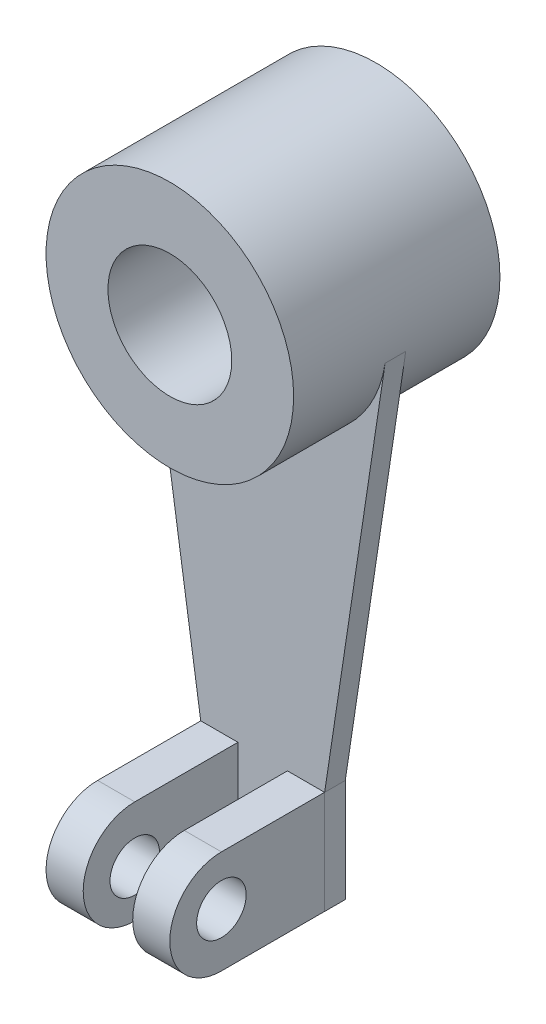
ISO-10303-21;
HEADER;
FILE_DESCRIPTION(('STEP AP214'),'2;1');
FILE_NAME('part.step','',(''),(''),'','','');
FILE_SCHEMA(('AUTOMOTIVE_DESIGN { 1 0 10303 214 1 1 1 1 }'));
ENDSEC;
DATA;
#1=APPLICATION_CONTEXT('core data for automotive mechanical design processes');
#2=APPLICATION_PROTOCOL_DEFINITION('international standard','automotive_design',2000,#1);
#3=PRODUCT_CONTEXT('',#1,'mechanical');
#4=PRODUCT('Part','Part','',(#3));
#5=PRODUCT_RELATED_PRODUCT_CATEGORY('part','',(#4));
#6=PRODUCT_DEFINITION_FORMATION('','',#4);
#7=PRODUCT_DEFINITION_CONTEXT('part definition',#1,'design');
#8=PRODUCT_DEFINITION('design','',#6,#7);
#9=PRODUCT_DEFINITION_SHAPE('','',#8);
#10=(LENGTH_UNIT() NAMED_UNIT(*) SI_UNIT(.MILLI.,.METRE.));
#11=(NAMED_UNIT(*) PLANE_ANGLE_UNIT() SI_UNIT($,.RADIAN.));
#12=(NAMED_UNIT(*) SI_UNIT($,.STERADIAN.) SOLID_ANGLE_UNIT());
#13=UNCERTAINTY_MEASURE_WITH_UNIT(LENGTH_MEASURE(1.E-05),#10,'distance_accuracy_value','');
#14=(GEOMETRIC_REPRESENTATION_CONTEXT(3) GLOBAL_UNCERTAINTY_ASSIGNED_CONTEXT((#13)) GLOBAL_UNIT_ASSIGNED_CONTEXT((#10,
#11,#12)) REPRESENTATION_CONTEXT('',''));
#15=CARTESIAN_POINT('',(0.,0.,0.));
#16=DIRECTION('',(0.,0.,1.));
#17=DIRECTION('',(1.,0.,0.));
#18=AXIS2_PLACEMENT_3D('',#15,#16,#17);
#19=CARTESIAN_POINT('',(0.,0.,2.5));
#20=DIRECTION('',(0.,0.,1.));
#21=DIRECTION('',(1.,0.,0.));
#22=AXIS2_PLACEMENT_3D('',#19,#20,#21);
#23=PLANE('',#22);
#24=DIRECTION('',(-1.,0.,0.));
#25=VECTOR('',#24,1.);
#26=CARTESIAN_POINT('',(-6.,-101.848781463455,2.5));
#27=LINE('',#26,#25);
#28=CARTESIAN_POINT('',(-6.,-101.848781463455,2.5));
#29=VERTEX_POINT('',#28);
#30=CARTESIAN_POINT('',(-15.,-101.848781463455,2.5));
#31=VERTEX_POINT('',#30);
#32=EDGE_CURVE('E51',#29,#31,#27,.T.);
#33=ORIENTED_EDGE('',*,*,#32,.F.);
#34=DIRECTION('',(0.,1.,0.));
#35=VECTOR('',#34,1.);
#36=CARTESIAN_POINT('',(-6.,-126.848781463455,2.5));
#37=LINE('',#36,#35);
#38=CARTESIAN_POINT('',(-6.,-126.848781463455,2.5));
#39=VERTEX_POINT('',#38);
#40=EDGE_CURVE('E173',#39,#29,#37,.T.);
#41=ORIENTED_EDGE('',*,*,#40,.F.);
#42=DIRECTION('',(1.,0.,0.));
#43=VECTOR('',#42,1.);
#44=CARTESIAN_POINT('',(0.,-126.848781463455,2.5));
#45=LINE('',#44,#43);
#46=CARTESIAN_POINT('',(6.,-126.848781463455,2.5));
#47=VERTEX_POINT('',#46);
#48=EDGE_CURVE('E172',#39,#47,#45,.T.);
#49=ORIENTED_EDGE('',*,*,#48,.T.);
#50=DIRECTION('',(0.,1.,0.));
#51=VECTOR('',#50,1.);
#52=CARTESIAN_POINT('',(6.,-126.848781463455,2.5));
#53=LINE('',#52,#51);
#54=CARTESIAN_POINT('',(6.,-101.848781463455,2.5));
#55=VERTEX_POINT('',#54);
#56=EDGE_CURVE('E237',#47,#55,#53,.T.);
#57=ORIENTED_EDGE('',*,*,#56,.T.);
#58=DIRECTION('',(1.,0.,0.));
#59=VECTOR('',#58,1.);
#60=CARTESIAN_POINT('',(6.,-101.848781463455,2.5));
#61=LINE('',#60,#59);
#62=CARTESIAN_POINT('',(15.,-101.848781463455,2.5));
#63=VERTEX_POINT('',#62);
#64=EDGE_CURVE('E248',#55,#63,#61,.T.);
#65=ORIENTED_EDGE('',*,*,#64,.T.);
#66=DIRECTION('',(0.,1.,0.));
#67=VECTOR('',#66,1.);
#68=CARTESIAN_POINT('',(15.,-126.848781463455,2.5));
#69=LINE('',#68,#67);
#70=CARTESIAN_POINT('',(15.,-126.848781463455,2.5));
#71=VERTEX_POINT('',#70);
#72=EDGE_CURVE('E205',#71,#63,#69,.T.);
#73=ORIENTED_EDGE('',*,*,#72,.F.);
#74=DIRECTION('',(-1.,0.,0.));
#75=VECTOR('',#74,1.);
#76=CARTESIAN_POINT('',(0.,-126.848781463455,2.5));
#77=LINE('',#76,#75);
#78=CARTESIAN_POINT('',(15.0190931986018,-126.848781463455,2.5));
#79=VERTEX_POINT('',#78);
#80=EDGE_CURVE('E189',#79,#71,#77,.T.);
#81=ORIENTED_EDGE('',*,*,#80,.F.);
#82=DIRECTION('',(0.,-1.,0.));
#83=VECTOR('',#82,1.);
#84=CARTESIAN_POINT('',(15.0190931986018,-126.848781463455,2.5));
#85=LINE('',#84,#83);
#86=CARTESIAN_POINT('',(15.0190931986018,-101.851653045865,2.5));
#87=VERTEX_POINT('',#86);
#88=EDGE_CURVE('E192',#87,#79,#85,.T.);
#89=ORIENTED_EDGE('',*,*,#88,.F.);
#90=DIRECTION('',(-0.148725533472455,-0.988878514122606,0.));
#91=VECTOR('',#90,1.);
#92=CARTESIAN_POINT('',(15.0190931986018,-101.851653045865,2.5));
#93=LINE('',#92,#91);
#94=CARTESIAN_POINT('',(29.6654801022645,-4.46758215393379,2.5));
#95=VERTEX_POINT('',#94);
#96=EDGE_CURVE('E196',#95,#87,#93,.T.);
#97=ORIENTED_EDGE('',*,*,#96,.F.);
#98=CARTESIAN_POINT('',(0.,0.,2.5));
#99=DIRECTION('',(0.,0.,-1.));
#100=DIRECTION('',(1.,0.,0.));
#101=AXIS2_PLACEMENT_3D('',#98,#99,#100);
#102=CIRCLE('',#101,30.);
#103=CARTESIAN_POINT('',(-29.66548038734,-4.46758219680862,2.5));
#104=VERTEX_POINT('',#103);
#105=EDGE_CURVE('E261',#95,#104,#102,.T.);
#106=ORIENTED_EDGE('',*,*,#105,.T.);
#107=DIRECTION('',(0.148725533472455,-0.988878514122606,0.));
#108=VECTOR('',#107,1.);
#109=CARTESIAN_POINT('',(-15.0190931986018,-101.851653045865,2.5));
#110=LINE('',#109,#108);
#111=CARTESIAN_POINT('',(-15.0190931986018,-101.851653045865,2.5));
#112=VERTEX_POINT('',#111);
#113=EDGE_CURVE('E37',#104,#112,#110,.T.);
#114=ORIENTED_EDGE('',*,*,#113,.T.);
#115=DIRECTION('',(0.,-1.,0.));
#116=VECTOR('',#115,1.);
#117=CARTESIAN_POINT('',(-15.0190931986018,-126.848781463455,2.5));
#118=LINE('',#117,#116);
#119=CARTESIAN_POINT('',(-15.0190931986018,-126.848781463455,2.5));
#120=VERTEX_POINT('',#119);
#121=EDGE_CURVE('E272',#112,#120,#118,.T.);
#122=ORIENTED_EDGE('',*,*,#121,.T.);
#123=CARTESIAN_POINT('',(-15.,-126.848781463455,2.5));
#124=VERTEX_POINT('',#123);
#125=EDGE_CURVE('E259',#120,#124,#45,.T.);
#126=ORIENTED_EDGE('',*,*,#125,.T.);
#127=DIRECTION('',(0.,1.,0.));
#128=VECTOR('',#127,1.);
#129=CARTESIAN_POINT('',(-15.,-126.848781463455,2.5));
#130=LINE('',#129,#128);
#131=EDGE_CURVE('E56',#124,#31,#130,.T.);
#132=ORIENTED_EDGE('',*,*,#131,.T.);
#133=EDGE_LOOP('',(#33,#41,#49,#57,#65,#73,#81,#89,#97,#106,#114,#122,#126,#132));
#134=FACE_BOUND('',#133,.T.);
#135=ADVANCED_FACE('F33',(#134),#23,.T.);
#136=CARTESIAN_POINT('',(0.,0.,25.));
#137=DIRECTION('',(0.,0.,-1.));
#138=DIRECTION('',(-1.,0.,0.));
#139=AXIS2_PLACEMENT_3D('',#136,#137,#138);
#140=CYLINDRICAL_SURFACE('',#139,30.);
#141=ORIENTED_EDGE('',*,*,#105,.F.);
#142=CARTESIAN_POINT('',(0.,0.,2.5));
#143=DIRECTION('',(0.,0.,1.));
#144=DIRECTION('',(-1.,0.,0.));
#145=AXIS2_PLACEMENT_3D('',#142,#143,#144);
#146=CIRCLE('',#145,30.);
#147=CARTESIAN_POINT('',(29.6663554236782,-4.46176600417366,2.5));
#148=VERTEX_POINT('',#147);
#149=EDGE_CURVE('E204',#95,#148,#146,.T.);
#150=ORIENTED_EDGE('',*,*,#149,.T.);
#151=DIRECTION('',(0.,0.,-1.));
#152=VECTOR('',#151,1.);
#153=CARTESIAN_POINT('',(29.6663554236782,-4.46176600417364,2.5));
#154=LINE('',#153,#152);
#155=CARTESIAN_POINT('',(29.6663554236782,-4.46176600417364,-2.5));
#156=VERTEX_POINT('',#155);
#157=EDGE_CURVE('E208',#148,#156,#154,.T.);
#158=ORIENTED_EDGE('',*,*,#157,.T.);
#159=DIRECTION('',(-0.148725533472455,-0.988878514122606,0.));
#160=VECTOR('',#159,1.);
#161=CARTESIAN_POINT('',(15.0190931986018,-101.851653045865,-2.5));
#162=LINE('',#161,#160);
#163=CARTESIAN_POINT('',(29.6654801022645,-4.46758215393379,-2.5));
#164=VERTEX_POINT('',#163);
#165=EDGE_CURVE('E193',#156,#164,#162,.T.);
#166=ORIENTED_EDGE('',*,*,#165,.T.);
#167=CARTESIAN_POINT('',(0.,0.,-2.5));
#168=DIRECTION('',(0.,0.,-1.));
#169=DIRECTION('',(1.,0.,0.));
#170=AXIS2_PLACEMENT_3D('',#167,#168,#169);
#171=CIRCLE('',#170,30.);
#172=CARTESIAN_POINT('',(-29.66548038734,-4.46758219680862,-2.5));
#173=VERTEX_POINT('',#172);
#174=EDGE_CURVE('E268',#164,#173,#171,.T.);
#175=ORIENTED_EDGE('',*,*,#174,.T.);
#176=CARTESIAN_POINT('',(-29.6663554236782,-4.46176600417366,-2.5));
#177=VERTEX_POINT('',#176);
#178=EDGE_CURVE('E318',#173,#177,#171,.T.);
#179=ORIENTED_EDGE('',*,*,#178,.T.);
#180=DIRECTION('',(0.,0.,-1.));
#181=VECTOR('',#180,1.);
#182=CARTESIAN_POINT('',(-29.6663554236782,-4.46176600417364,2.5));
#183=LINE('',#182,#181);
#184=CARTESIAN_POINT('',(-29.6663554236782,-4.46176600417366,2.5));
#185=VERTEX_POINT('',#184);
#186=EDGE_CURVE('E290',#185,#177,#183,.T.);
#187=ORIENTED_EDGE('',*,*,#186,.F.);
#188=EDGE_CURVE('E271',#185,#104,#110,.T.);
#189=ORIENTED_EDGE('',*,*,#188,.T.);
#190=EDGE_LOOP('',(#141,#150,#158,#166,#175,#179,#187,#189));
#191=FACE_BOUND('',#190,.T.);
#192=CARTESIAN_POINT('',(0.,0.,25.));
#193=DIRECTION('',(0.,0.,1.));
#194=DIRECTION('',(1.,0.,0.));
#195=AXIS2_PLACEMENT_3D('',#192,#193,#194);
#196=CIRCLE('',#195,30.);
#197=CARTESIAN_POINT('',(30.,0.,25.));
#198=VERTEX_POINT('',#197);
#199=EDGE_CURVE('E11',#198,#198,#196,.T.);
#200=ORIENTED_EDGE('',*,*,#199,.F.);
#201=EDGE_LOOP('',(#200));
#202=FACE_BOUND('',#201,.T.);
#203=CARTESIAN_POINT('',(0.,0.,-25.));
#204=DIRECTION('',(0.,0.,1.));
#205=DIRECTION('',(1.,0.,0.));
#206=AXIS2_PLACEMENT_3D('',#203,#204,#205);
#207=CIRCLE('',#206,30.);
#208=CARTESIAN_POINT('',(30.,0.,-25.));
#209=VERTEX_POINT('',#208);
#210=EDGE_CURVE('E43',#209,#209,#207,.T.);
#211=ORIENTED_EDGE('',*,*,#210,.T.);
#212=EDGE_LOOP('',(#211));
#213=FACE_BOUND('',#212,.T.);
#214=ADVANCED_FACE('F35',(#191,#202,#213),#140,.T.);
#215=CARTESIAN_POINT('',(0.,0.,25.));
#216=DIRECTION('',(0.,0.,1.));
#217=DIRECTION('',(1.,0.,0.));
#218=AXIS2_PLACEMENT_3D('',#215,#216,#217);
#219=PLANE('',#218);
#220=CARTESIAN_POINT('',(0.,0.,25.));
#221=DIRECTION('',(0.,0.,1.));
#222=DIRECTION('',(1.,0.,0.));
#223=AXIS2_PLACEMENT_3D('',#220,#221,#222);
#224=CIRCLE('',#223,15.);
#225=CARTESIAN_POINT('',(15.,0.,25.));
#226=VERTEX_POINT('',#225);
#227=EDGE_CURVE('E330',#226,#226,#224,.T.);
#228=ORIENTED_EDGE('',*,*,#227,.F.);
#229=EDGE_LOOP('',(#228));
#230=FACE_BOUND('',#229,.T.);
#231=ORIENTED_EDGE('',*,*,#199,.T.);
#232=EDGE_LOOP('',(#231));
#233=FACE_BOUND('',#232,.T.);
#234=ADVANCED_FACE('F364',(#230,#233),#219,.T.);
#235=CARTESIAN_POINT('',(0.,0.,-25.));
#236=DIRECTION('',(0.,0.,1.));
#237=DIRECTION('',(1.,0.,0.));
#238=AXIS2_PLACEMENT_3D('',#235,#236,#237);
#239=PLANE('',#238);
#240=CARTESIAN_POINT('',(0.,0.,-25.));
#241=DIRECTION('',(0.,0.,1.));
#242=DIRECTION('',(1.,0.,0.));
#243=AXIS2_PLACEMENT_3D('',#240,#241,#242);
#244=CIRCLE('',#243,15.);
#245=CARTESIAN_POINT('',(15.,0.,-25.));
#246=VERTEX_POINT('',#245);
#247=EDGE_CURVE('E328',#246,#246,#244,.T.);
#248=ORIENTED_EDGE('',*,*,#247,.T.);
#249=EDGE_LOOP('',(#248));
#250=FACE_BOUND('',#249,.T.);
#251=ORIENTED_EDGE('',*,*,#210,.F.);
#252=EDGE_LOOP('',(#251));
#253=FACE_BOUND('',#252,.T.);
#254=ADVANCED_FACE('F383',(#250,#253),#239,.F.);
#255=CARTESIAN_POINT('',(0.,0.,-25.));
#256=DIRECTION('',(0.,0.,1.));
#257=DIRECTION('',(1.,0.,0.));
#258=AXIS2_PLACEMENT_3D('',#255,#256,#257);
#259=CYLINDRICAL_SURFACE('',#258,15.);
#260=ORIENTED_EDGE('',*,*,#247,.F.);
#261=EDGE_LOOP('',(#260));
#262=FACE_BOUND('',#261,.T.);
#263=ORIENTED_EDGE('',*,*,#227,.T.);
#264=EDGE_LOOP('',(#263));
#265=FACE_BOUND('',#264,.T.);
#266=ADVANCED_FACE('F380',(#262,#265),#259,.F.);
#267=CARTESIAN_POINT('',(0.,-126.848781463455,2.5));
#268=DIRECTION('',(0.,1.,0.));
#269=DIRECTION('',(0.,0.,1.));
#270=AXIS2_PLACEMENT_3D('',#267,#268,#269);
#271=PLANE('',#270);
#272=DIRECTION('',(0.,0.,-1.));
#273=VECTOR('',#272,1.);
#274=CARTESIAN_POINT('',(6.,-126.848781463455,27.5));
#275=LINE('',#274,#273);
#276=CARTESIAN_POINT('',(6.,-126.848781463455,27.5));
#277=VERTEX_POINT('',#276);
#278=EDGE_CURVE('E246',#277,#47,#275,.T.);
#279=ORIENTED_EDGE('',*,*,#278,.T.);
#280=ORIENTED_EDGE('',*,*,#48,.F.);
#281=DIRECTION('',(0.,0.,-1.));
#282=VECTOR('',#281,1.);
#283=CARTESIAN_POINT('',(-6.,-126.848781463455,27.5));
#284=LINE('',#283,#282);
#285=CARTESIAN_POINT('',(-6.,-126.848781463455,27.5));
#286=VERTEX_POINT('',#285);
#287=EDGE_CURVE('E153',#286,#39,#284,.T.);
#288=ORIENTED_EDGE('',*,*,#287,.F.);
#289=DIRECTION('',(-1.,0.,0.));
#290=VECTOR('',#289,1.);
#291=CARTESIAN_POINT('',(-6.,-126.848781463455,27.5));
#292=LINE('',#291,#290);
#293=CARTESIAN_POINT('',(-15.,-126.848781463455,27.5));
#294=VERTEX_POINT('',#293);
#295=EDGE_CURVE('E160',#286,#294,#292,.T.);
#296=ORIENTED_EDGE('',*,*,#295,.T.);
#297=DIRECTION('',(0.,0.,-1.));
#298=VECTOR('',#297,1.);
#299=CARTESIAN_POINT('',(-15.,-126.848781463455,27.5));
#300=LINE('',#299,#298);
#301=EDGE_CURVE('E181',#294,#124,#300,.T.);
#302=ORIENTED_EDGE('',*,*,#301,.T.);
#303=ORIENTED_EDGE('',*,*,#125,.F.);
#304=DIRECTION('',(0.,0.,-1.));
#305=VECTOR('',#304,1.);
#306=CARTESIAN_POINT('',(-15.0190931986018,-126.848781463455,2.5));
#307=LINE('',#306,#305);
#308=CARTESIAN_POINT('',(-15.0190931986018,-126.848781463455,-2.5));
#309=VERTEX_POINT('',#308);
#310=EDGE_CURVE('E275',#120,#309,#307,.T.);
#311=ORIENTED_EDGE('',*,*,#310,.T.);
#312=DIRECTION('',(1.,0.,0.));
#313=VECTOR('',#312,1.);
#314=CARTESIAN_POINT('',(0.,-126.848781463455,-2.5));
#315=LINE('',#314,#313);
#316=CARTESIAN_POINT('',(15.0190931986018,-126.848781463455,-2.5));
#317=VERTEX_POINT('',#316);
#318=EDGE_CURVE('E255',#309,#317,#315,.T.);
#319=ORIENTED_EDGE('',*,*,#318,.T.);
#320=DIRECTION('',(0.,0.,-1.));
#321=VECTOR('',#320,1.);
#322=CARTESIAN_POINT('',(15.0190931986018,-126.848781463455,2.5));
#323=LINE('',#322,#321);
#324=EDGE_CURVE('E219',#79,#317,#323,.T.);
#325=ORIENTED_EDGE('',*,*,#324,.F.);
#326=ORIENTED_EDGE('',*,*,#80,.T.);
#327=DIRECTION('',(0.,0.,-1.));
#328=VECTOR('',#327,1.);
#329=CARTESIAN_POINT('',(15.,-126.848781463455,2.5));
#330=LINE('',#329,#328);
#331=CARTESIAN_POINT('',(15.,-126.848781463455,27.5));
#332=VERTEX_POINT('',#331);
#333=EDGE_CURVE('E308',#332,#71,#330,.T.);
#334=ORIENTED_EDGE('',*,*,#333,.F.);
#335=DIRECTION('',(1.,0.,0.));
#336=VECTOR('',#335,1.);
#337=CARTESIAN_POINT('',(6.,-126.848781463455,27.5));
#338=LINE('',#337,#336);
#339=EDGE_CURVE('E252',#277,#332,#338,.T.);
#340=ORIENTED_EDGE('',*,*,#339,.F.);
#341=EDGE_LOOP('',(#279,#280,#288,#296,#302,#303,#311,#319,#325,#326,#334,#340));
#342=FACE_BOUND('',#341,.T.);
#343=ADVANCED_FACE('F171',(#342),#271,.F.);
#344=CARTESIAN_POINT('',(15.,-126.848781463455,2.5));
#345=DIRECTION('',(-1.,0.,0.));
#346=DIRECTION('',(0.,0.,1.));
#347=AXIS2_PLACEMENT_3D('',#344,#345,#346);
#348=PLANE('',#347);
#349=CARTESIAN_POINT('',(15.,-113.848781463455,27.5));
#350=DIRECTION('',(1.,0.,0.));
#351=DIRECTION('',(0.,0.,-1.));
#352=AXIS2_PLACEMENT_3D('',#349,#350,#351);
#353=CIRCLE('',#352,5.99999999999999);
#354=CARTESIAN_POINT('',(15.,-113.848781463455,21.5));
#355=VERTEX_POINT('',#354);
#356=EDGE_CURVE('E224',#355,#355,#353,.T.);
#357=ORIENTED_EDGE('',*,*,#356,.F.);
#358=EDGE_LOOP('',(#357));
#359=FACE_BOUND('',#358,.T.);
#360=ORIENTED_EDGE('',*,*,#333,.T.);
#361=ORIENTED_EDGE('',*,*,#72,.T.);
#362=DIRECTION('',(0.,0.,1.));
#363=VECTOR('',#362,1.);
#364=CARTESIAN_POINT('',(15.,-101.848781463455,2.5));
#365=LINE('',#364,#363);
#366=CARTESIAN_POINT('',(15.,-101.848781463455,27.5));
#367=VERTEX_POINT('',#366);
#368=EDGE_CURVE('E235',#63,#367,#365,.T.);
#369=ORIENTED_EDGE('',*,*,#368,.T.);
#370=CARTESIAN_POINT('',(15.,-114.348781463455,27.5));
#371=DIRECTION('',(1.,0.,0.));
#372=DIRECTION('',(0.,0.,-1.));
#373=AXIS2_PLACEMENT_3D('',#370,#371,#372);
#374=CIRCLE('',#373,12.5);
#375=EDGE_CURVE('E240',#367,#332,#374,.T.);
#376=ORIENTED_EDGE('',*,*,#375,.T.);
#377=EDGE_LOOP('',(#360,#361,#369,#376));
#378=FACE_BOUND('',#377,.T.);
#379=ADVANCED_FACE('F374',(#359,#378),#348,.F.);
#380=CARTESIAN_POINT('',(-15.0190931986018,-101.851653045865,2.5));
#381=DIRECTION('',(0.988878514122606,0.148725533472455,0.));
#382=DIRECTION('',(-0.148725533472455,0.988878514122606,0.));
#383=AXIS2_PLACEMENT_3D('',#380,#381,#382);
#384=PLANE('',#383);
#385=ORIENTED_EDGE('',*,*,#113,.F.);
#386=ORIENTED_EDGE('',*,*,#188,.F.);
#387=ORIENTED_EDGE('',*,*,#186,.T.);
#388=ORIENTED_EDGE('',*,*,#178,.F.);
#389=DIRECTION('',(0.148725533472455,-0.988878514122606,0.));
#390=VECTOR('',#389,1.);
#391=CARTESIAN_POINT('',(-15.0190931986018,-101.851653045865,-2.5));
#392=LINE('',#391,#390);
#393=CARTESIAN_POINT('',(-15.0190931986018,-101.851653045865,-2.5));
#394=VERTEX_POINT('',#393);
#395=EDGE_CURVE('E286',#173,#394,#392,.T.);
#396=ORIENTED_EDGE('',*,*,#395,.T.);
#397=DIRECTION('',(0.,0.,-1.));
#398=VECTOR('',#397,1.);
#399=CARTESIAN_POINT('',(-15.0190931986018,-101.851653045865,2.5));
#400=LINE('',#399,#398);
#401=EDGE_CURVE('E283',#112,#394,#400,.T.);
#402=ORIENTED_EDGE('',*,*,#401,.F.);
#403=EDGE_LOOP('',(#385,#386,#387,#388,#396,#402));
#404=FACE_BOUND('',#403,.T.);
#405=ADVANCED_FACE('F284',(#404),#384,.F.);
#406=CARTESIAN_POINT('',(-15.0190931986018,-126.848781463455,2.5));
#407=DIRECTION('',(1.,0.,0.));
#408=DIRECTION('',(0.,0.,-1.));
#409=AXIS2_PLACEMENT_3D('',#406,#407,#408);
#410=PLANE('',#409);
#411=DIRECTION('',(0.,-1.,0.));
#412=VECTOR('',#411,1.);
#413=CARTESIAN_POINT('',(-15.0190931986018,-126.848781463455,-2.5));
#414=LINE('',#413,#412);
#415=EDGE_CURVE('E295',#394,#309,#414,.T.);
#416=ORIENTED_EDGE('',*,*,#415,.T.);
#417=ORIENTED_EDGE('',*,*,#310,.F.);
#418=ORIENTED_EDGE('',*,*,#121,.F.);
#419=ORIENTED_EDGE('',*,*,#401,.T.);
#420=EDGE_LOOP('',(#416,#417,#418,#419));
#421=FACE_BOUND('',#420,.T.);
#422=ADVANCED_FACE('F292',(#421),#410,.F.);
#423=CARTESIAN_POINT('',(0.,0.,-2.5));
#424=DIRECTION('',(0.,0.,1.));
#425=DIRECTION('',(1.,0.,0.));
#426=AXIS2_PLACEMENT_3D('',#423,#424,#425);
#427=PLANE('',#426);
#428=ORIENTED_EDGE('',*,*,#395,.F.);
#429=ORIENTED_EDGE('',*,*,#174,.F.);
#430=CARTESIAN_POINT('',(15.0190931986018,-101.851653045865,-2.5));
#431=VERTEX_POINT('',#430);
#432=EDGE_CURVE('E211',#164,#431,#162,.T.);
#433=ORIENTED_EDGE('',*,*,#432,.T.);
#434=DIRECTION('',(0.,-1.,0.));
#435=VECTOR('',#434,1.);
#436=CARTESIAN_POINT('',(15.0190931986018,-126.848781463455,-2.5));
#437=LINE('',#436,#435);
#438=EDGE_CURVE('E187',#431,#317,#437,.T.);
#439=ORIENTED_EDGE('',*,*,#438,.T.);
#440=ORIENTED_EDGE('',*,*,#318,.F.);
#441=ORIENTED_EDGE('',*,*,#415,.F.);
#442=EDGE_LOOP('',(#428,#429,#433,#439,#440,#441));
#443=FACE_BOUND('',#442,.T.);
#444=ADVANCED_FACE('F342',(#443),#427,.F.);
#445=CARTESIAN_POINT('',(6.,-114.348781463455,27.5));
#446=DIRECTION('',(1.,0.,0.));
#447=DIRECTION('',(0.,0.,-1.));
#448=AXIS2_PLACEMENT_3D('',#445,#446,#447);
#449=CYLINDRICAL_SURFACE('',#448,12.5);
#450=ORIENTED_EDGE('',*,*,#375,.F.);
#451=DIRECTION('',(1.,0.,0.));
#452=VECTOR('',#451,1.);
#453=CARTESIAN_POINT('',(6.,-101.848781463455,27.5));
#454=LINE('',#453,#452);
#455=CARTESIAN_POINT('',(6.,-101.848781463455,27.5));
#456=VERTEX_POINT('',#455);
#457=EDGE_CURVE('E256',#456,#367,#454,.T.);
#458=ORIENTED_EDGE('',*,*,#457,.F.);
#459=CARTESIAN_POINT('',(6.,-114.348781463455,27.5));
#460=DIRECTION('',(1.,0.,0.));
#461=DIRECTION('',(0.,0.,-1.));
#462=AXIS2_PLACEMENT_3D('',#459,#460,#461);
#463=CIRCLE('',#462,12.5);
#464=EDGE_CURVE('E243',#456,#277,#463,.T.);
#465=ORIENTED_EDGE('',*,*,#464,.T.);
#466=ORIENTED_EDGE('',*,*,#339,.T.);
#467=EDGE_LOOP('',(#450,#458,#465,#466));
#468=FACE_BOUND('',#467,.T.);
#469=ADVANCED_FACE('F311',(#468),#449,.T.);
#470=CARTESIAN_POINT('',(6.,-101.848781463455,2.5));
#471=DIRECTION('',(0.,1.,0.));
#472=DIRECTION('',(0.,0.,1.));
#473=AXIS2_PLACEMENT_3D('',#470,#471,#472);
#474=PLANE('',#473);
#475=ORIENTED_EDGE('',*,*,#368,.F.);
#476=ORIENTED_EDGE('',*,*,#64,.F.);
#477=DIRECTION('',(0.,0.,1.));
#478=VECTOR('',#477,1.);
#479=CARTESIAN_POINT('',(6.,-101.848781463455,2.5));
#480=LINE('',#479,#478);
#481=EDGE_CURVE('E239',#55,#456,#480,.T.);
#482=ORIENTED_EDGE('',*,*,#481,.T.);
#483=ORIENTED_EDGE('',*,*,#457,.T.);
#484=EDGE_LOOP('',(#475,#476,#482,#483));
#485=FACE_BOUND('',#484,.T.);
#486=ADVANCED_FACE('F314',(#485),#474,.T.);
#487=CARTESIAN_POINT('',(6.,-114.348781463455,27.5));
#488=DIRECTION('',(1.,0.,0.));
#489=DIRECTION('',(0.,0.,-1.));
#490=AXIS2_PLACEMENT_3D('',#487,#488,#489);
#491=PLANE('',#490);
#492=CARTESIAN_POINT('',(6.,-113.848781463455,27.5));
#493=DIRECTION('',(1.,0.,0.));
#494=DIRECTION('',(0.,0.,-1.));
#495=AXIS2_PLACEMENT_3D('',#492,#493,#494);
#496=CIRCLE('',#495,5.99999999999999);
#497=CARTESIAN_POINT('',(6.,-113.848781463455,21.5));
#498=VERTEX_POINT('',#497);
#499=EDGE_CURVE('E230',#498,#498,#496,.F.);
#500=ORIENTED_EDGE('',*,*,#499,.F.);
#501=EDGE_LOOP('',(#500));
#502=FACE_BOUND('',#501,.T.);
#503=ORIENTED_EDGE('',*,*,#56,.F.);
#504=ORIENTED_EDGE('',*,*,#278,.F.);
#505=ORIENTED_EDGE('',*,*,#464,.F.);
#506=ORIENTED_EDGE('',*,*,#481,.F.);
#507=EDGE_LOOP('',(#503,#504,#505,#506));
#508=FACE_BOUND('',#507,.T.);
#509=ADVANCED_FACE('F306',(#502,#508),#491,.F.);
#510=CARTESIAN_POINT('',(15.,-113.848781463455,27.5));
#511=DIRECTION('',(1.,0.,0.));
#512=DIRECTION('',(0.,0.,-1.));
#513=AXIS2_PLACEMENT_3D('',#510,#511,#512);
#514=CYLINDRICAL_SURFACE('',#513,5.99999999999999);
#515=ORIENTED_EDGE('',*,*,#499,.T.);
#516=EDGE_LOOP('',(#515));
#517=FACE_BOUND('',#516,.T.);
#518=ORIENTED_EDGE('',*,*,#356,.T.);
#519=EDGE_LOOP('',(#518));
#520=FACE_BOUND('',#519,.T.);
#521=ADVANCED_FACE('F350',(#517,#520),#514,.F.);
#522=CARTESIAN_POINT('',(15.0190931986018,-126.848781463455,2.5));
#523=DIRECTION('',(1.,0.,0.));
#524=DIRECTION('',(0.,0.,-1.));
#525=AXIS2_PLACEMENT_3D('',#522,#523,#524);
#526=PLANE('',#525);
#527=ORIENTED_EDGE('',*,*,#438,.F.);
#528=DIRECTION('',(0.,0.,-1.));
#529=VECTOR('',#528,1.);
#530=CARTESIAN_POINT('',(15.0190931986018,-101.851653045865,2.5));
#531=LINE('',#530,#529);
#532=EDGE_CURVE('E217',#87,#431,#531,.T.);
#533=ORIENTED_EDGE('',*,*,#532,.F.);
#534=ORIENTED_EDGE('',*,*,#88,.T.);
#535=ORIENTED_EDGE('',*,*,#324,.T.);
#536=EDGE_LOOP('',(#527,#533,#534,#535));
#537=FACE_BOUND('',#536,.T.);
#538=ADVANCED_FACE('F347',(#537),#526,.T.);
#539=CARTESIAN_POINT('',(15.0190931986018,-101.851653045865,2.5));
#540=DIRECTION('',(0.988878514122606,-0.148725533472455,0.));
#541=DIRECTION('',(0.148725533472455,0.988878514122606,0.));
#542=AXIS2_PLACEMENT_3D('',#539,#540,#541);
#543=PLANE('',#542);
#544=ORIENTED_EDGE('',*,*,#165,.F.);
#545=ORIENTED_EDGE('',*,*,#157,.F.);
#546=ORIENTED_EDGE('',*,*,#149,.F.);
#547=ORIENTED_EDGE('',*,*,#96,.T.);
#548=ORIENTED_EDGE('',*,*,#532,.T.);
#549=ORIENTED_EDGE('',*,*,#432,.F.);
#550=EDGE_LOOP('',(#544,#545,#546,#547,#548,#549));
#551=FACE_BOUND('',#550,.T.);
#552=ADVANCED_FACE('F344',(#551),#543,.T.);
#553=CARTESIAN_POINT('',(-6.,-101.848781463455,2.5));
#554=DIRECTION('',(0.,-1.,0.));
#555=DIRECTION('',(0.,0.,-1.));
#556=AXIS2_PLACEMENT_3D('',#553,#554,#555);
#557=PLANE('',#556);
#558=DIRECTION('',(0.,0.,1.));
#559=VECTOR('',#558,1.);
#560=CARTESIAN_POINT('',(-15.,-101.848781463455,2.5));
#561=LINE('',#560,#559);
#562=CARTESIAN_POINT('',(-15.,-101.848781463455,27.5));
#563=VERTEX_POINT('',#562);
#564=EDGE_CURVE('E175',#31,#563,#561,.T.);
#565=ORIENTED_EDGE('',*,*,#564,.T.);
#566=DIRECTION('',(-1.,0.,0.));
#567=VECTOR('',#566,1.);
#568=CARTESIAN_POINT('',(-6.,-101.848781463455,27.5));
#569=LINE('',#568,#567);
#570=CARTESIAN_POINT('',(-6.,-101.848781463455,27.5));
#571=VERTEX_POINT('',#570);
#572=EDGE_CURVE('E167',#571,#563,#569,.T.);
#573=ORIENTED_EDGE('',*,*,#572,.F.);
#574=DIRECTION('',(0.,0.,1.));
#575=VECTOR('',#574,1.);
#576=CARTESIAN_POINT('',(-6.,-101.848781463455,2.5));
#577=LINE('',#576,#575);
#578=EDGE_CURVE('E154',#29,#571,#577,.T.);
#579=ORIENTED_EDGE('',*,*,#578,.F.);
#580=ORIENTED_EDGE('',*,*,#32,.T.);
#581=EDGE_LOOP('',(#565,#573,#579,#580));
#582=FACE_BOUND('',#581,.T.);
#583=ADVANCED_FACE('F300',(#582),#557,.F.);
#584=CARTESIAN_POINT('',(-6.,-114.348781463455,27.5));
#585=DIRECTION('',(-1.,0.,0.));
#586=DIRECTION('',(0.,0.,1.));
#587=AXIS2_PLACEMENT_3D('',#584,#585,#586);
#588=CYLINDRICAL_SURFACE('',#587,12.5);
#589=CARTESIAN_POINT('',(-15.,-114.348781463455,27.5));
#590=DIRECTION('',(1.,0.,0.));
#591=DIRECTION('',(0.,0.,-1.));
#592=AXIS2_PLACEMENT_3D('',#589,#590,#591);
#593=CIRCLE('',#592,12.5);
#594=EDGE_CURVE('E163',#563,#294,#593,.T.);
#595=ORIENTED_EDGE('',*,*,#594,.T.);
#596=ORIENTED_EDGE('',*,*,#295,.F.);
#597=CARTESIAN_POINT('',(-6.,-114.348781463455,27.5));
#598=DIRECTION('',(1.,0.,0.));
#599=DIRECTION('',(0.,0.,-1.));
#600=AXIS2_PLACEMENT_3D('',#597,#598,#599);
#601=CIRCLE('',#600,12.5);
#602=EDGE_CURVE('E148',#571,#286,#601,.T.);
#603=ORIENTED_EDGE('',*,*,#602,.F.);
#604=ORIENTED_EDGE('',*,*,#572,.T.);
#605=EDGE_LOOP('',(#595,#596,#603,#604));
#606=FACE_BOUND('',#605,.T.);
#607=ADVANCED_FACE('F161',(#606),#588,.T.);
#608=CARTESIAN_POINT('',(-6.,-114.348781463455,27.5));
#609=DIRECTION('',(-1.,0.,0.));
#610=DIRECTION('',(0.,0.,-1.));
#611=AXIS2_PLACEMENT_3D('',#608,#609,#610);
#612=PLANE('',#611);
#613=CARTESIAN_POINT('',(-6.,-115.421061469164,27.5));
#614=DIRECTION('',(-1.,0.,0.));
#615=DIRECTION('',(0.,0.,1.));
#616=AXIS2_PLACEMENT_3D('',#613,#614,#615);
#617=CIRCLE('',#616,6.);
#618=CARTESIAN_POINT('',(-6.,-115.421061469164,33.5));
#619=VERTEX_POINT('',#618);
#620=EDGE_CURVE('E182',#619,#619,#617,.F.);
#621=ORIENTED_EDGE('',*,*,#620,.F.);
#622=EDGE_LOOP('',(#621));
#623=FACE_BOUND('',#622,.T.);
#624=ORIENTED_EDGE('',*,*,#40,.T.);
#625=ORIENTED_EDGE('',*,*,#578,.T.);
#626=ORIENTED_EDGE('',*,*,#602,.T.);
#627=ORIENTED_EDGE('',*,*,#287,.T.);
#628=EDGE_LOOP('',(#624,#625,#626,#627));
#629=FACE_BOUND('',#628,.T.);
#630=ADVANCED_FACE('F151',(#623,#629),#612,.F.);
#631=CARTESIAN_POINT('',(-15.,-114.348781463455,27.5));
#632=DIRECTION('',(-1.,0.,0.));
#633=DIRECTION('',(0.,0.,-1.));
#634=AXIS2_PLACEMENT_3D('',#631,#632,#633);
#635=PLANE('',#634);
#636=CARTESIAN_POINT('',(-15.,-115.421061469164,27.5));
#637=DIRECTION('',(-1.,0.,0.));
#638=DIRECTION('',(0.,0.,1.));
#639=AXIS2_PLACEMENT_3D('',#636,#637,#638);
#640=CIRCLE('',#639,5.99999999999999);
#641=CARTESIAN_POINT('',(-15.,-115.421061469164,33.5));
#642=VERTEX_POINT('',#641);
#643=EDGE_CURVE('E557',#642,#642,#640,.T.);
#644=ORIENTED_EDGE('',*,*,#643,.F.);
#645=EDGE_LOOP('',(#644));
#646=FACE_BOUND('',#645,.T.);
#647=ORIENTED_EDGE('',*,*,#131,.F.);
#648=ORIENTED_EDGE('',*,*,#301,.F.);
#649=ORIENTED_EDGE('',*,*,#594,.F.);
#650=ORIENTED_EDGE('',*,*,#564,.F.);
#651=EDGE_LOOP('',(#647,#648,#649,#650));
#652=FACE_BOUND('',#651,.T.);
#653=ADVANCED_FACE('F298',(#646,#652),#635,.T.);
#654=CARTESIAN_POINT('',(-15.,-115.421061469164,27.5));
#655=DIRECTION('',(-1.,0.,0.));
#656=DIRECTION('',(0.,0.,1.));
#657=AXIS2_PLACEMENT_3D('',#654,#655,#656);
#658=CYLINDRICAL_SURFACE('',#657,6.);
#659=ORIENTED_EDGE('',*,*,#620,.T.);
#660=EDGE_LOOP('',(#659));
#661=FACE_BOUND('',#660,.T.);
#662=ORIENTED_EDGE('',*,*,#643,.T.);
#663=EDGE_LOOP('',(#662));
#664=FACE_BOUND('',#663,.T.);
#665=ADVANCED_FACE('F538',(#661,#664),#658,.F.);
#666=CLOSED_SHELL('',(#135,#214,#234,#254,#266,#343,#379,#405,#422,#444,#469,#486,#509,#521,
#538,#552,#583,#607,#630,#653,#665));
#667=MANIFOLD_SOLID_BREP('B2',#666);
#668=ADVANCED_BREP_SHAPE_REPRESENTATION('',(#18,#667),#14);
#669=SHAPE_DEFINITION_REPRESENTATION(#9,#668);
ENDSEC;
END-ISO-10303-21;
